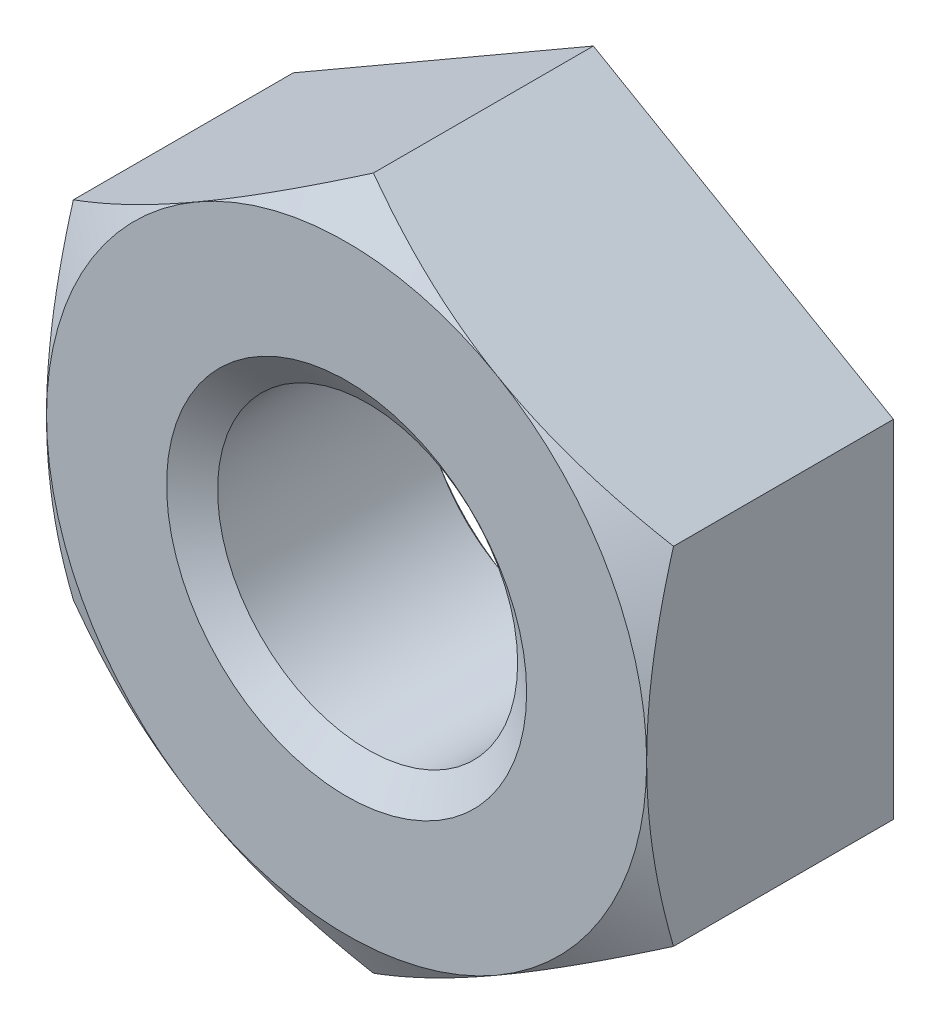
ISO-10303-21;
HEADER;
FILE_DESCRIPTION(('STEP AP214'),'2;1');
FILE_NAME('part.step','',(''),(''),'','','');
FILE_SCHEMA(('AUTOMOTIVE_DESIGN { 1 0 10303 214 1 1 1 1 }'));
ENDSEC;
DATA;
#1=APPLICATION_CONTEXT('core data for automotive mechanical design processes');
#2=APPLICATION_PROTOCOL_DEFINITION('international standard','automotive_design',2000,#1);
#3=PRODUCT_CONTEXT('',#1,'mechanical');
#4=PRODUCT('Part','Part','',(#3));
#5=PRODUCT_RELATED_PRODUCT_CATEGORY('part','',(#4));
#6=PRODUCT_DEFINITION_FORMATION('','',#4);
#7=PRODUCT_DEFINITION_CONTEXT('part definition',#1,'design');
#8=PRODUCT_DEFINITION('design','',#6,#7);
#9=PRODUCT_DEFINITION_SHAPE('','',#8);
#10=(LENGTH_UNIT() NAMED_UNIT(*) SI_UNIT(.MILLI.,.METRE.));
#11=(NAMED_UNIT(*) PLANE_ANGLE_UNIT() SI_UNIT($,.RADIAN.));
#12=(NAMED_UNIT(*) SI_UNIT($,.STERADIAN.) SOLID_ANGLE_UNIT());
#13=UNCERTAINTY_MEASURE_WITH_UNIT(LENGTH_MEASURE(1.E-05),#10,'distance_accuracy_value','');
#14=(GEOMETRIC_REPRESENTATION_CONTEXT(3) GLOBAL_UNCERTAINTY_ASSIGNED_CONTEXT((#13)) GLOBAL_UNIT_ASSIGNED_CONTEXT((#10,
#11,#12)) REPRESENTATION_CONTEXT('',''));
#15=CARTESIAN_POINT('',(0.,0.,0.));
#16=DIRECTION('',(0.,0.,1.));
#17=DIRECTION('',(1.,0.,0.));
#18=AXIS2_PLACEMENT_3D('',#15,#16,#17);
#19=CARTESIAN_POINT('',(0.,0.,-6.5278));
#20=DIRECTION('',(0.,0.,1.));
#21=DIRECTION('',(1.,0.,0.));
#22=AXIS2_PLACEMENT_3D('',#19,#20,#21);
#23=CYLINDRICAL_SURFACE('',#22,3.96875);
#24=CARTESIAN_POINT('',(0.,0.,-0.555789733453956));
#25=DIRECTION('',(0.,0.,1.));
#26=DIRECTION('',(1.,0.,0.));
#27=AXIS2_PLACEMENT_3D('',#24,#25,#26);
#28=CIRCLE('',#27,3.96875);
#29=CARTESIAN_POINT('',(3.96875,0.,-0.555789733453956));
#30=VERTEX_POINT('',#29);
#31=EDGE_CURVE('E131',#30,#30,#28,.F.);
#32=ORIENTED_EDGE('',*,*,#31,.F.);
#33=EDGE_LOOP('',(#32));
#34=FACE_BOUND('',#33,.T.);
#35=CARTESIAN_POINT('',(0.,0.,-5.94661026654604));
#36=DIRECTION('',(0.,0.,-1.));
#37=DIRECTION('',(-1.,0.,0.));
#38=AXIS2_PLACEMENT_3D('',#35,#36,#37);
#39=CIRCLE('',#38,3.96875);
#40=CARTESIAN_POINT('',(-3.96875,0.,-5.94661026654604));
#41=VERTEX_POINT('',#40);
#42=EDGE_CURVE('E37',#41,#41,#39,.F.);
#43=ORIENTED_EDGE('',*,*,#42,.F.);
#44=EDGE_LOOP('',(#43));
#45=FACE_BOUND('',#44,.T.);
#46=ADVANCED_FACE('F32',(#34,#45),#23,.F.);
#47=CARTESIAN_POINT('',(7.9375,13.7481532850777,-6.5278));
#48=DIRECTION('',(0.,0.,1.));
#49=DIRECTION('',(1.,0.,0.));
#50=AXIS2_PLACEMENT_3D('',#47,#48,#49);
#51=PLANE('',#50);
#52=DIRECTION('',(-0.866025403784448,-0.499999999999983,0.));
#53=VECTOR('',#52,1.);
#54=CARTESIAN_POINT('',(0.,9.16543552338532,-6.5278));
#55=LINE('',#54,#53);
#56=CARTESIAN_POINT('',(0.,9.16543552338532,-6.5278));
#57=VERTEX_POINT('',#56);
#58=CARTESIAN_POINT('',(-7.9375,4.58271776169282,-6.5278));
#59=VERTEX_POINT('',#58);
#60=EDGE_CURVE('E254',#57,#59,#55,.T.);
#61=ORIENTED_EDGE('',*,*,#60,.F.);
#62=DIRECTION('',(-0.866025403784428,0.500000000000019,0.));
#63=VECTOR('',#62,1.);
#64=CARTESIAN_POINT('',(7.9375,4.58271776169249,-6.5278));
#65=LINE('',#64,#63);
#66=CARTESIAN_POINT('',(7.9375,4.58271776169249,-6.5278));
#67=VERTEX_POINT('',#66);
#68=EDGE_CURVE('E230',#67,#57,#65,.T.);
#69=ORIENTED_EDGE('',*,*,#68,.F.);
#70=DIRECTION('',(0.,-1.,0.));
#71=VECTOR('',#70,1.);
#72=CARTESIAN_POINT('',(7.9375,4.58271776169249,-6.5278));
#73=LINE('',#72,#71);
#74=CARTESIAN_POINT('',(7.9375,-4.58271776169282,-6.5278));
#75=VERTEX_POINT('',#74);
#76=EDGE_CURVE('E243',#67,#75,#73,.T.);
#77=ORIENTED_EDGE('',*,*,#76,.T.);
#78=DIRECTION('',(0.866025403784449,0.499999999999982,0.));
#79=VECTOR('',#78,1.);
#80=CARTESIAN_POINT('',(0.,-9.1654355233853,-6.5278));
#81=LINE('',#80,#79);
#82=CARTESIAN_POINT('',(0.,-9.1654355233853,-6.5278));
#83=VERTEX_POINT('',#82);
#84=EDGE_CURVE('E245',#83,#75,#81,.T.);
#85=ORIENTED_EDGE('',*,*,#84,.F.);
#86=DIRECTION('',(0.866025403784429,-0.500000000000017,0.));
#87=VECTOR('',#86,1.);
#88=CARTESIAN_POINT('',(-7.9375,-4.58271776169249,-6.5278));
#89=LINE('',#88,#87);
#90=CARTESIAN_POINT('',(-7.9375,-4.58271776169249,-6.5278));
#91=VERTEX_POINT('',#90);
#92=EDGE_CURVE('E248',#91,#83,#89,.T.);
#93=ORIENTED_EDGE('',*,*,#92,.F.);
#94=DIRECTION('',(0.,-1.,0.));
#95=VECTOR('',#94,1.);
#96=CARTESIAN_POINT('',(-7.9375,4.58271776169282,-6.5278));
#97=LINE('',#96,#95);
#98=EDGE_CURVE('E251',#59,#91,#97,.T.);
#99=ORIENTED_EDGE('',*,*,#98,.F.);
#100=EDGE_LOOP('',(#61,#69,#77,#85,#93,#99));
#101=FACE_BOUND('',#100,.T.);
#102=CARTESIAN_POINT('',(0.,0.,-6.5278));
#103=DIRECTION('',(0.,0.,1.));
#104=DIRECTION('',(1.,0.,0.));
#105=AXIS2_PLACEMENT_3D('',#102,#103,#104);
#106=CIRCLE('',#105,4.7625);
#107=CARTESIAN_POINT('',(4.7625,0.,-6.5278));
#108=VERTEX_POINT('',#107);
#109=EDGE_CURVE('E215',#108,#108,#106,.F.);
#110=ORIENTED_EDGE('',*,*,#109,.F.);
#111=EDGE_LOOP('',(#110));
#112=FACE_BOUND('',#111,.T.);
#113=ADVANCED_FACE('F202',(#101,#112),#51,.F.);
#114=CARTESIAN_POINT('',(7.9375,13.7481532850777,0.));
#115=DIRECTION('',(0.,0.,1.));
#116=DIRECTION('',(1.,0.,0.));
#117=AXIS2_PLACEMENT_3D('',#114,#115,#116);
#118=PLANE('',#117);
#119=CARTESIAN_POINT('',(0.,0.,0.));
#120=DIRECTION('',(0.,0.,1.));
#121=DIRECTION('',(1.,0.,0.));
#122=AXIS2_PLACEMENT_3D('',#119,#120,#121);
#123=CIRCLE('',#122,7.9375);
#124=CARTESIAN_POINT('',(7.9375,0.,0.));
#125=VERTEX_POINT('',#124);
#126=CARTESIAN_POINT('',(3.96874999999985,-6.87407664253907,0.));
#127=VERTEX_POINT('',#126);
#128=EDGE_CURVE('E11',#125,#127,#123,.F.);
#129=ORIENTED_EDGE('',*,*,#128,.F.);
#130=CARTESIAN_POINT('',(0.,0.,0.));
#131=DIRECTION('',(0.,0.,1.));
#132=DIRECTION('',(1.,0.,0.));
#133=AXIS2_PLACEMENT_3D('',#130,#131,#132);
#134=CIRCLE('',#133,7.9375);
#135=CARTESIAN_POINT('',(3.96875000000015,6.8740766425389,0.));
#136=VERTEX_POINT('',#135);
#137=EDGE_CURVE('E123',#125,#136,#134,.T.);
#138=ORIENTED_EDGE('',*,*,#137,.T.);
#139=CARTESIAN_POINT('',(-3.96874999999987,6.87407664253906,0.));
#140=VERTEX_POINT('',#139);
#141=EDGE_CURVE('E44',#140,#136,#123,.F.);
#142=ORIENTED_EDGE('',*,*,#141,.F.);
#143=CARTESIAN_POINT('',(-7.9375,0.,0.));
#144=VERTEX_POINT('',#143);
#145=EDGE_CURVE('E283',#144,#140,#123,.F.);
#146=ORIENTED_EDGE('',*,*,#145,.F.);
#147=CARTESIAN_POINT('',(-3.96875000000013,-6.8740766425389,0.));
#148=VERTEX_POINT('',#147);
#149=EDGE_CURVE('E281',#148,#144,#123,.F.);
#150=ORIENTED_EDGE('',*,*,#149,.F.);
#151=EDGE_CURVE('E42',#127,#148,#123,.F.);
#152=ORIENTED_EDGE('',*,*,#151,.F.);
#153=EDGE_LOOP('',(#129,#138,#142,#146,#150,#152));
#154=FACE_BOUND('',#153,.T.);
#155=CARTESIAN_POINT('',(0.,0.,0.));
#156=DIRECTION('',(0.,0.,1.));
#157=DIRECTION('',(1.,0.,0.));
#158=AXIS2_PLACEMENT_3D('',#155,#156,#157);
#159=CIRCLE('',#158,4.7625);
#160=CARTESIAN_POINT('',(4.7625,0.,0.));
#161=VERTEX_POINT('',#160);
#162=EDGE_CURVE('E214',#161,#161,#159,.T.);
#163=ORIENTED_EDGE('',*,*,#162,.F.);
#164=EDGE_LOOP('',(#163));
#165=FACE_BOUND('',#164,.T.);
#166=ADVANCED_FACE('F133',(#154,#165),#118,.T.);
#167=CARTESIAN_POINT('',(0.,9.16543552338532,-6.5278));
#168=DIRECTION('',(-0.499999999999983,0.866025403784448,0.));
#169=DIRECTION('',(-0.866025403784448,-0.499999999999983,0.));
#170=AXIS2_PLACEMENT_3D('',#167,#168,#169);
#171=PLANE('',#170);
#172=DIRECTION('',(0.,0.,1.));
#173=VECTOR('',#172,1.);
#174=CARTESIAN_POINT('',(-7.9375,4.58271776169282,-6.5278));
#175=LINE('',#174,#173);
#176=CARTESIAN_POINT('',(-7.9375,4.58271776169282,-0.708948904974025));
#177=VERTEX_POINT('',#176);
#178=EDGE_CURVE('E226',#59,#177,#175,.T.);
#179=ORIENTED_EDGE('',*,*,#178,.T.);
#180=CARTESIAN_POINT('',(-7.9377,4.58260229163898,-0.709015572900557));
#181=CARTESIAN_POINT('',(-7.76322502158793,4.68333546739203,-0.650866285897806));
#182=CARTESIAN_POINT('',(-7.58809953864738,4.78444421210972,-0.595356039210498));
#183=CARTESIAN_POINT('',(-7.23642632358312,4.98748283749384,-0.490340491808437));
#184=CARTESIAN_POINT('',(-7.05987801235101,5.08941305250867,-0.440837783112786));
#185=CARTESIAN_POINT('',(-6.52740632749454,5.39683572309639,-0.302312723142144));
#186=CARTESIAN_POINT('',(-6.16938105017105,5.60354171333579,-0.22352145135917));
#187=CARTESIAN_POINT('',(-5.63360314162946,5.91287323305812,-0.131129350120179));
#188=CARTESIAN_POINT('',(-5.45745113218669,6.01457464312819,-0.104809503727462));
#189=CARTESIAN_POINT('',(-5.10435050058562,6.21843738783409,-0.0606755611211759));
#190=CARTESIAN_POINT('',(-4.92740195020686,6.32059868102797,-0.0428607133854932));
#191=CARTESIAN_POINT('',(-4.57320017052289,6.52509717387595,-0.0161882579708196));
#192=CARTESIAN_POINT('',(-4.39594751669924,6.6274340412756,-0.00732048505628382));
#193=CARTESIAN_POINT('',(-4.04127846358514,6.83220231456425,0.00126770549344349));
#194=CARTESIAN_POINT('',(-3.86386206952283,6.93463371743477,0.000988405729546576));
#195=CARTESIAN_POINT('',(-3.53217533850321,7.12613314087557,-0.00808134398121452));
#196=CARTESIAN_POINT('',(-3.37788159577035,7.21521467477666,-0.0157654088390289));
#197=CARTESIAN_POINT('',(-3.06965548223459,7.39316910439779,-0.0379026215782631));
#198=CARTESIAN_POINT('',(-2.91572313649499,7.48204198564753,-0.0523562257657692));
#199=CARTESIAN_POINT('',(-2.45452203220573,7.74831656735948,-0.105529699236206));
#200=CARTESIAN_POINT('',(-2.14806963971136,7.92524693865991,-0.154055589218117));
#201=CARTESIAN_POINT('',(-1.5319140460875,8.28098453650132,-0.275371211073317));
#202=CARTESIAN_POINT('',(-1.22228948290784,8.4597463614008,-0.348675201689165));
#203=CARTESIAN_POINT('',(-0.607657694775784,8.81460418973133,-0.51504499141566));
#204=CARTESIAN_POINT('',(-0.302642598800529,8.99070473749954,-0.608071713945547));
#205=CARTESIAN_POINT('',(0.000200000000093219,9.16555099343916,-0.709015572900516));
#206=B_SPLINE_CURVE_WITH_KNOTS('',3,(#180,#181,#182,#183,#184,#185,#186,#187,#188,#189,#190,
#191,#192,#193,#194,#195,#196,#197,#198,#199,#200,#201,#202,#203,#204,#205),.UNSPECIFIED.,.F.,
.F.,(4,2,2,2,2,2,2,2,2,2,2,2,4),(0.,0.629020687135161,1.25831181455686,2.51950872534228,
3.13466137542382,3.74975965907415,4.36415830804195,4.97853797504025,5.51339074736729,
6.04827957705292,7.11881916910901,8.21310135188793,9.30523536686631),.UNSPECIFIED.);
#207=EDGE_CURVE('E117',#177,#140,#206,.T.);
#208=ORIENTED_EDGE('',*,*,#207,.T.);
#209=CARTESIAN_POINT('',(0.,9.16543552338532,-0.708948904974024));
#210=VERTEX_POINT('',#209);
#211=EDGE_CURVE('E144',#140,#210,#206,.T.);
#212=ORIENTED_EDGE('',*,*,#211,.T.);
#213=DIRECTION('',(0.,0.,1.));
#214=VECTOR('',#213,1.);
#215=CARTESIAN_POINT('',(0.,9.16543552338532,-6.5278));
#216=LINE('',#215,#214);
#217=EDGE_CURVE('E238',#57,#210,#216,.T.);
#218=ORIENTED_EDGE('',*,*,#217,.F.);
#219=ORIENTED_EDGE('',*,*,#60,.T.);
#220=EDGE_LOOP('',(#179,#208,#212,#218,#219));
#221=FACE_BOUND('',#220,.T.);
#222=ADVANCED_FACE('F34',(#221),#171,.T.);
#223=CARTESIAN_POINT('',(7.9375,4.58271776169249,-6.5278));
#224=DIRECTION('',(0.500000000000019,0.866025403784428,0.));
#225=DIRECTION('',(-0.866025403784428,0.500000000000019,0.));
#226=AXIS2_PLACEMENT_3D('',#223,#224,#225);
#227=PLANE('',#226);
#228=ORIENTED_EDGE('',*,*,#217,.T.);
#229=CARTESIAN_POINT('',(-0.000199999999906354,9.16555099343916,-0.709015572900516));
#230=CARTESIAN_POINT('',(0.174274978412156,9.06481781768609,-0.650866285897766));
#231=CARTESIAN_POINT('',(0.349400461352702,8.9637090729684,-0.595356039210459));
#232=CARTESIAN_POINT('',(0.701073676416952,8.76067044758427,-0.490340491808398));
#233=CARTESIAN_POINT('',(0.877621987649049,8.65874023256944,-0.440837783112746));
#234=CARTESIAN_POINT('',(1.41009367250551,8.35131756198169,-0.302312723142103));
#235=CARTESIAN_POINT('',(1.76811894982899,8.14461157174228,-0.223521451359126));
#236=CARTESIAN_POINT('',(2.30389685837056,7.83528005201993,-0.131129350120134));
#237=CARTESIAN_POINT('',(2.48004886781333,7.73357864194985,-0.104809503727416));
#238=CARTESIAN_POINT('',(2.83314949941439,7.52971589724395,-0.0606755611211281));
#239=CARTESIAN_POINT('',(3.01009804979314,7.42755460405005,-0.0428607133854447));
#240=CARTESIAN_POINT('',(3.3642998294771,7.22305611120206,-0.0161882579707695));
#241=CARTESIAN_POINT('',(3.54155248330074,7.1207192438024,-0.00732048505623273));
#242=CARTESIAN_POINT('',(3.89622153641483,6.91595097051374,0.00126770549349606));
#243=CARTESIAN_POINT('',(4.07363793047713,6.81351956764322,0.000988405729599736));
#244=CARTESIAN_POINT('',(4.40532466149675,6.6220201442024,-0.00808134398115901));
#245=CARTESIAN_POINT('',(4.55961840422961,6.53293861030131,-0.0157654088389719));
#246=CARTESIAN_POINT('',(4.86784451776536,6.35498418068016,-0.037902621578205));
#247=CARTESIAN_POINT('',(5.02177686350495,6.26611129943041,-0.0523562257657114));
#248=CARTESIAN_POINT('',(5.48297796779421,5.99983671771844,-0.105529699236148));
#249=CARTESIAN_POINT('',(5.78943036028858,5.822906346418,-0.154055589218059));
#250=CARTESIAN_POINT('',(6.40558595391243,5.46716874857657,-0.275371211073259));
#251=CARTESIAN_POINT('',(6.71521051709208,5.28840692367706,-0.348675201689107));
#252=CARTESIAN_POINT('',(7.32984230522413,4.9335490953465,-0.515044991415605));
#253=CARTESIAN_POINT('',(7.63485740119938,4.75744854757828,-0.608071713945493));
#254=CARTESIAN_POINT('',(7.9377,4.58260229163865,-0.709015572900463));
#255=B_SPLINE_CURVE_WITH_KNOTS('',3,(#229,#230,#231,#232,#233,#234,#235,#236,#237,#238,#239,
#240,#241,#242,#243,#244,#245,#246,#247,#248,#249,#250,#251,#252,#253,#254),.UNSPECIFIED.,.F.,
.F.,(4,2,2,2,2,2,2,2,2,2,2,2,4),(0.,0.629020687135155,1.25831181455685,2.51950872534226,
3.1346613754238,3.74975965907412,4.36415830804191,4.97853797504022,5.51339074736726,
6.0482795770529,7.118819169109,8.21310135188792,9.30523536686632),.UNSPECIFIED.);
#256=EDGE_CURVE('E140',#210,#136,#255,.T.);
#257=ORIENTED_EDGE('',*,*,#256,.T.);
#258=CARTESIAN_POINT('',(7.9375,4.58271776169268,-0.708948904974024));
#259=VERTEX_POINT('',#258);
#260=EDGE_CURVE('E126',#136,#259,#255,.T.);
#261=ORIENTED_EDGE('',*,*,#260,.T.);
#262=DIRECTION('',(0.,0.,1.));
#263=VECTOR('',#262,1.);
#264=CARTESIAN_POINT('',(7.9375,4.58271776169249,-6.5278));
#265=LINE('',#264,#263);
#266=EDGE_CURVE('E139',#67,#259,#265,.T.);
#267=ORIENTED_EDGE('',*,*,#266,.F.);
#268=ORIENTED_EDGE('',*,*,#68,.T.);
#269=EDGE_LOOP('',(#228,#257,#261,#267,#268));
#270=FACE_BOUND('',#269,.T.);
#271=ADVANCED_FACE('F259',(#270),#227,.T.);
#272=CARTESIAN_POINT('',(7.9375,4.58271776169249,-6.5278));
#273=DIRECTION('',(-1.,0.,0.));
#274=DIRECTION('',(0.,0.,1.));
#275=AXIS2_PLACEMENT_3D('',#272,#273,#274);
#276=PLANE('',#275);
#277=CARTESIAN_POINT('',(7.9375,-12.1540428550748,-3.79830572339944));
#278=CARTESIAN_POINT('',(7.9375,-11.8055417137513,-3.62989072544695));
#279=CARTESIAN_POINT('',(7.9375,-11.4562166090856,-3.46314991100229));
#280=CARTESIAN_POINT('',(7.9375,-10.7554729351183,-3.13397333785365));
#281=CARTESIAN_POINT('',(7.9375,-10.4040540160887,-2.97153832452219));
#282=CARTESIAN_POINT('',(7.9375,-9.69677883875674,-2.65107432577963));
#283=CARTESIAN_POINT('',(7.9375,-9.34090869565808,-2.493075873726));
#284=CARTESIAN_POINT('',(7.9375,-8.62624353744283,-2.18386537817083));
#285=CARTESIAN_POINT('',(7.9375,-8.26744867594113,-2.03265298092497));
#286=CARTESIAN_POINT('',(7.9375,-7.54190895000615,-1.73702395542255));
#287=CARTESIAN_POINT('',(7.9375,-7.17512056255615,-1.59271354918174));
#288=CARTESIAN_POINT('',(7.9375,-6.4372184580145,-1.31539498874067));
#289=CARTESIAN_POINT('',(7.9375,-6.066104264908,-1.18238809199672));
#290=CARTESIAN_POINT('',(7.9375,-5.31971777432218,-0.931250932769843));
#291=CARTESIAN_POINT('',(7.9375,-4.94445623605253,-0.813089042609656));
#292=CARTESIAN_POINT('',(7.9375,-4.18861180807505,-0.595477465323819));
#293=CARTESIAN_POINT('',(7.9375,-3.80803064222036,-0.496021860734109));
#294=CARTESIAN_POINT('',(7.9375,-3.04122341725149,-0.320658395772122));
#295=CARTESIAN_POINT('',(7.9375,-2.65499588371972,-0.244756805288624));
#296=CARTESIAN_POINT('',(7.9375,-2.07225592781309,-0.152370391651535));
#297=CARTESIAN_POINT('',(7.9375,-1.87741892555741,-0.125150577555811));
#298=CARTESIAN_POINT('',(7.9375,-1.48683143967858,-0.0784018471326011));
#299=CARTESIAN_POINT('',(7.9375,-1.29108104843307,-0.0588721694033841));
#300=CARTESIAN_POINT('',(7.9375,-0.900173147631191,-0.0280292816344309));
#301=CARTESIAN_POINT('',(7.9375,-0.705019680022335,-0.0166650499450556));
#302=CARTESIAN_POINT('',(7.9375,-0.314406625859884,-0.00221313706756384));
#303=CARTESIAN_POINT('',(7.9375,-0.118947043314611,0.000874651601976459));
#304=CARTESIAN_POINT('',(7.9375,0.271871450970486,-0.00129989647433458));
#305=CARTESIAN_POINT('',(7.9375,0.467230375568073,-0.00655988978079132));
#306=CARTESIAN_POINT('',(7.9375,0.857556246985908,-0.0252991998003059));
#307=CARTESIAN_POINT('',(7.9375,1.05252317374343,-0.0387789269758079));
#308=CARTESIAN_POINT('',(7.9375,1.52506297457954,-0.0811297065316129));
#309=CARTESIAN_POINT('',(7.9375,1.80227278881696,-0.114119139529962));
#310=CARTESIAN_POINT('',(7.9375,2.35456818411291,-0.194883786983908));
#311=CARTESIAN_POINT('',(7.9375,2.62965316433381,-0.242663037198066));
#312=CARTESIAN_POINT('',(7.9375,3.17747194953975,-0.351312741869484));
#313=CARTESIAN_POINT('',(7.9375,3.45020327611589,-0.412195574142739));
#314=CARTESIAN_POINT('',(7.9375,3.99285991142013,-0.545194835610296));
#315=CARTESIAN_POINT('',(7.9375,4.26278548193587,-0.617310206545772));
#316=CARTESIAN_POINT('',(7.9375,4.80647881225565,-0.772934354165223));
#317=CARTESIAN_POINT('',(7.9375,5.08017856871108,-0.856679077611889));
#318=CARTESIAN_POINT('',(7.9375,5.62468506827777,-1.03244298730137));
#319=CARTESIAN_POINT('',(7.9375,5.89549366465436,-1.12445646631555));
#320=CARTESIAN_POINT('',(7.9375,6.43313118794731,-1.31485725841808));
#321=CARTESIAN_POINT('',(7.9375,6.69997393537356,-1.4132057801201));
#322=CARTESIAN_POINT('',(7.9375,7.23158910056609,-1.61567532168825));
#323=CARTESIAN_POINT('',(7.9375,7.49636063153353,-1.71979867460119));
#324=CARTESIAN_POINT('',(7.9375,7.76017027676662,-1.82623818485622));
#325=B_SPLINE_CURVE_WITH_KNOTS('',3,(#277,#278,#279,#280,#281,#282,#283,#284,#285,#286,#287,
#288,#289,#290,#291,#292,#293,#294,#295,#296,#297,#298,#299,#300,#301,#302,#303,#304,#305,#306,
#307,#308,#309,#310,#311,#312,#313,#314,#315,#316,#317,#318,#319,#320,#321,#322,#323,#324),
.UNSPECIFIED.,.F.,.F.,(4,2,2,2,2,2,2,2,2,2,2,2,2,2,2,2,2,2,2,2,2,2,2,4),(0.,1.16120027580623,
2.3226002700954,3.49064648750631,4.65863174596449,5.84095623854381,7.02341208683705,
8.20330434634276,9.38282273386193,10.5626548308775,11.1527144520002,11.7427156365191,
12.3289973680831,12.9152714859051,13.501381050453,14.0875198854945,14.9245510617841,
15.7618108438773,16.5998650111811,17.4378402700213,18.2963561134772,19.1542838811018,
20.007382654881,20.8608286295793),.UNSPECIFIED.);
#326=CARTESIAN_POINT('',(7.93749999999988,-4.58271776169289,-0.708948904974024));
#327=VERTEX_POINT('',#326);
#328=EDGE_CURVE('E106',#327,#125,#325,.T.);
#329=ORIENTED_EDGE('',*,*,#328,.F.);
#330=DIRECTION('',(0.,0.,1.));
#331=VECTOR('',#330,1.);
#332=CARTESIAN_POINT('',(7.9375,-4.58271776169282,-6.5278));
#333=LINE('',#332,#331);
#334=EDGE_CURVE('E235',#75,#327,#333,.T.);
#335=ORIENTED_EDGE('',*,*,#334,.F.);
#336=ORIENTED_EDGE('',*,*,#76,.F.);
#337=ORIENTED_EDGE('',*,*,#266,.T.);
#338=EDGE_CURVE('E119',#125,#259,#325,.T.);
#339=ORIENTED_EDGE('',*,*,#338,.F.);
#340=EDGE_LOOP('',(#329,#335,#336,#337,#339));
#341=FACE_BOUND('',#340,.T.);
#342=ADVANCED_FACE('F137',(#341),#276,.F.);
#343=CARTESIAN_POINT('',(0.,-9.1654355233853,-6.5278));
#344=DIRECTION('',(0.499999999999982,-0.866025403784449,0.));
#345=DIRECTION('',(0.866025403784449,0.499999999999982,0.));
#346=AXIS2_PLACEMENT_3D('',#343,#344,#345);
#347=PLANE('',#346);
#348=ORIENTED_EDGE('',*,*,#334,.T.);
#349=CARTESIAN_POINT('',(7.9377,-4.58260229163898,-0.709015572900558));
#350=CARTESIAN_POINT('',(7.76322502158793,-4.68333546739203,-0.650866285897806));
#351=CARTESIAN_POINT('',(7.58809953864738,-4.78444421210972,-0.595356039210498));
#352=CARTESIAN_POINT('',(7.23642632358312,-4.98748283749384,-0.490340491808437));
#353=CARTESIAN_POINT('',(7.05987801235102,-5.08941305250867,-0.440837783112786));
#354=CARTESIAN_POINT('',(6.52740632749454,-5.39683572309639,-0.302312723142144));
#355=CARTESIAN_POINT('',(6.16938105017104,-5.60354171333579,-0.223521451359168));
#356=CARTESIAN_POINT('',(5.63360314162946,-5.91287323305811,-0.131129350120177));
#357=CARTESIAN_POINT('',(5.45745113218668,-6.01457464312819,-0.10480950372746));
#358=CARTESIAN_POINT('',(5.10435050058561,-6.21843738783408,-0.0606755611211729));
#359=CARTESIAN_POINT('',(4.92740195020686,-6.32059868102797,-0.0428607133854897));
#360=CARTESIAN_POINT('',(4.57320017052289,-6.52509717387594,-0.0161882579708161));
#361=CARTESIAN_POINT('',(4.39594751669924,-6.6274340412756,-0.00732048505628075));
#362=CARTESIAN_POINT('',(4.04127846358514,-6.83220231456424,0.00126770549344693));
#363=CARTESIAN_POINT('',(3.86386206952283,-6.93463371743477,0.000988405729550845));
#364=CARTESIAN_POINT('',(3.5321753385032,-7.12613314087556,-0.00808134398120885));
#365=CARTESIAN_POINT('',(3.37788159577034,-7.21521467477665,-0.0157654088390226));
#366=CARTESIAN_POINT('',(3.06965548223458,-7.39316910439778,-0.0379026215782569));
#367=CARTESIAN_POINT('',(2.91572313649499,-7.48204198564752,-0.0523562257657636));
#368=CARTESIAN_POINT('',(2.45452203220573,-7.74831656735947,-0.105529699236201));
#369=CARTESIAN_POINT('',(2.14806963971136,-7.92524693865989,-0.15405558921811));
#370=CARTESIAN_POINT('',(1.5319140460875,-8.2809845365013,-0.275371211073308));
#371=CARTESIAN_POINT('',(1.22228948290784,-8.45974636140079,-0.348675201689155));
#372=CARTESIAN_POINT('',(0.607657694775785,-8.81460418973132,-0.51504499141565));
#373=CARTESIAN_POINT('',(0.30264259880053,-8.99070473749952,-0.608071713945536));
#374=CARTESIAN_POINT('',(-0.000200000000092865,-9.16555099343914,-0.709015572900504));
#375=B_SPLINE_CURVE_WITH_KNOTS('',3,(#349,#350,#351,#352,#353,#354,#355,#356,#357,#358,#359,
#360,#361,#362,#363,#364,#365,#366,#367,#368,#369,#370,#371,#372,#373,#374),.UNSPECIFIED.,.F.,
.F.,(4,2,2,2,2,2,2,2,2,2,2,2,4),(0.,0.62902068713516,1.25831181455686,2.51950872534228,
3.13466137542383,3.74975965907415,4.36415830804195,4.97853797504025,5.5133907473673,
6.04827957705292,7.11881916910901,8.21310135188792,9.3052353668663),.UNSPECIFIED.);
#376=EDGE_CURVE('E112',#327,#127,#375,.T.);
#377=ORIENTED_EDGE('',*,*,#376,.T.);
#378=CARTESIAN_POINT('',(0.,-9.16543552338532,-0.708948904974024));
#379=VERTEX_POINT('',#378);
#380=EDGE_CURVE('E51',#127,#379,#375,.T.);
#381=ORIENTED_EDGE('',*,*,#380,.T.);
#382=DIRECTION('',(0.,0.,1.));
#383=VECTOR('',#382,1.);
#384=CARTESIAN_POINT('',(0.,-9.1654355233853,-6.5278));
#385=LINE('',#384,#383);
#386=EDGE_CURVE('E232',#83,#379,#385,.T.);
#387=ORIENTED_EDGE('',*,*,#386,.F.);
#388=ORIENTED_EDGE('',*,*,#84,.T.);
#389=EDGE_LOOP('',(#348,#377,#381,#387,#388));
#390=FACE_BOUND('',#389,.T.);
#391=ADVANCED_FACE('F191',(#390),#347,.T.);
#392=CARTESIAN_POINT('',(-7.9375,-4.58271776169249,-6.5278));
#393=DIRECTION('',(-0.500000000000017,-0.866025403784429,0.));
#394=DIRECTION('',(0.866025403784429,-0.500000000000017,0.));
#395=AXIS2_PLACEMENT_3D('',#392,#393,#394);
#396=PLANE('',#395);
#397=ORIENTED_EDGE('',*,*,#386,.T.);
#398=CARTESIAN_POINT('',(0.000199999999906325,-9.16555099343914,-0.709015572900505));
#399=CARTESIAN_POINT('',(-0.174274978412156,-9.06481781768607,-0.650866285897754));
#400=CARTESIAN_POINT('',(-0.349400461352702,-8.96370907296838,-0.595356039210447));
#401=CARTESIAN_POINT('',(-0.701073676416951,-8.76067044758425,-0.490340491808387));
#402=CARTESIAN_POINT('',(-0.877621987649049,-8.65874023256942,-0.440837783112736));
#403=CARTESIAN_POINT('',(-1.41009367250551,-8.35131756198168,-0.302312723142094));
#404=CARTESIAN_POINT('',(-1.76811894982899,-8.14461157174226,-0.223521451359119));
#405=CARTESIAN_POINT('',(-2.30389685837056,-7.83528005201992,-0.131129350120127));
#406=CARTESIAN_POINT('',(-2.48004886781333,-7.73357864194984,-0.10480950372741));
#407=CARTESIAN_POINT('',(-2.83314949941438,-7.52971589724393,-0.0606755611211221));
#408=CARTESIAN_POINT('',(-3.01009804979313,-7.42755460405004,-0.0428607133854382));
#409=CARTESIAN_POINT('',(-3.36429982947709,-7.22305611120205,-0.0161882579707635));
#410=CARTESIAN_POINT('',(-3.54155248330074,-7.12071924380239,-0.00732048505622771));
#411=CARTESIAN_POINT('',(-3.89622153641483,-6.91595097051374,0.00126770549350055));
#412=CARTESIAN_POINT('',(-4.07363793047713,-6.81351956764321,0.000988405729604666));
#413=CARTESIAN_POINT('',(-4.40532466149675,-6.6220201442024,-0.00808134398115464));
#414=CARTESIAN_POINT('',(-4.5596184042296,-6.5329386103013,-0.0157654088389684));
#415=CARTESIAN_POINT('',(-4.86784451776536,-6.35498418068015,-0.0379026215782024));
#416=CARTESIAN_POINT('',(-5.02177686350495,-6.2661112994304,-0.0523562257657089));
#417=CARTESIAN_POINT('',(-5.48297796779421,-5.99983671771844,-0.105529699236146));
#418=CARTESIAN_POINT('',(-5.78943036028858,-5.822906346418,-0.154055589218057));
#419=CARTESIAN_POINT('',(-6.40558595391242,-5.46716874857657,-0.275371211073257));
#420=CARTESIAN_POINT('',(-6.71521051709208,-5.28840692367706,-0.348675201689105));
#421=CARTESIAN_POINT('',(-7.32984230522413,-4.93354909534651,-0.515044991415604));
#422=CARTESIAN_POINT('',(-7.63485740119938,-4.75744854757829,-0.608071713945493));
#423=CARTESIAN_POINT('',(-7.9377,-4.58260229163866,-0.709015572900464));
#424=B_SPLINE_CURVE_WITH_KNOTS('',3,(#398,#399,#400,#401,#402,#403,#404,#405,#406,#407,#408,
#409,#410,#411,#412,#413,#414,#415,#416,#417,#418,#419,#420,#421,#422,#423),.UNSPECIFIED.,.F.,
.F.,(4,2,2,2,2,2,2,2,2,2,2,2,4),(0.,0.629020687135154,1.25831181455685,2.51950872534225,
3.13466137542379,3.74975965907412,4.36415830804191,4.97853797504021,5.51339074736725,
6.04827957705289,7.11881916910898,8.21310135188791,9.3052353668663),.UNSPECIFIED.);
#425=EDGE_CURVE('E185',#379,#148,#424,.T.);
#426=ORIENTED_EDGE('',*,*,#425,.T.);
#427=CARTESIAN_POINT('',(-7.9375,-4.58271776169268,-0.708948904974024));
#428=VERTEX_POINT('',#427);
#429=EDGE_CURVE('E58',#148,#428,#424,.T.);
#430=ORIENTED_EDGE('',*,*,#429,.T.);
#431=DIRECTION('',(0.,0.,1.));
#432=VECTOR('',#431,1.);
#433=CARTESIAN_POINT('',(-7.9375,-4.58271776169249,-6.5278));
#434=LINE('',#433,#432);
#435=EDGE_CURVE('E229',#91,#428,#434,.T.);
#436=ORIENTED_EDGE('',*,*,#435,.F.);
#437=ORIENTED_EDGE('',*,*,#92,.T.);
#438=EDGE_LOOP('',(#397,#426,#430,#436,#437));
#439=FACE_BOUND('',#438,.T.);
#440=ADVANCED_FACE('F187',(#439),#396,.T.);
#441=CARTESIAN_POINT('',(-7.9375,4.58271776169282,-6.5278));
#442=DIRECTION('',(-1.,0.,0.));
#443=DIRECTION('',(0.,-1.,0.));
#444=AXIS2_PLACEMENT_3D('',#441,#442,#443);
#445=PLANE('',#444);
#446=ORIENTED_EDGE('',*,*,#435,.T.);
#447=CARTESIAN_POINT('',(-7.93750000000001,-12.1540428550746,-3.79830572339936));
#448=CARTESIAN_POINT('',(-7.9375,-11.8055417137511,-3.62989072544688));
#449=CARTESIAN_POINT('',(-7.9375,-11.4562166090855,-3.46314991100222));
#450=CARTESIAN_POINT('',(-7.9375,-10.7554729351181,-3.13397333785358));
#451=CARTESIAN_POINT('',(-7.9375,-10.4040540160885,-2.97153832452213));
#452=CARTESIAN_POINT('',(-7.9375,-9.69677883875659,-2.65107432577957));
#453=CARTESIAN_POINT('',(-7.9375,-9.34090869565794,-2.49307587372594));
#454=CARTESIAN_POINT('',(-7.9375,-8.6262435374427,-2.18386537817077));
#455=CARTESIAN_POINT('',(-7.9375,-8.26744867594099,-2.03265298092491));
#456=CARTESIAN_POINT('',(-7.9375,-7.54190895000601,-1.7370239554225));
#457=CARTESIAN_POINT('',(-7.9375,-7.17512056255602,-1.59271354918169));
#458=CARTESIAN_POINT('',(-7.9375,-6.43721845801438,-1.31539498874063));
#459=CARTESIAN_POINT('',(-7.9375,-6.06610426490787,-1.18238809199668));
#460=CARTESIAN_POINT('',(-7.9375,-5.31971777432206,-0.931250932769806));
#461=CARTESIAN_POINT('',(-7.9375,-4.94445623605241,-0.813089042609621));
#462=CARTESIAN_POINT('',(-7.9375,-4.18861180807494,-0.595477465323789));
#463=CARTESIAN_POINT('',(-7.9375,-3.80803064222025,-0.496021860734083));
#464=CARTESIAN_POINT('',(-7.9375,-3.04122341725139,-0.320658395772102));
#465=CARTESIAN_POINT('',(-7.9375,-2.65499588371962,-0.244756805288607));
#466=CARTESIAN_POINT('',(-7.9375,-2.072255927813,-0.152370391651522));
#467=CARTESIAN_POINT('',(-7.9375,-1.87741892555732,-0.1251505775558));
#468=CARTESIAN_POINT('',(-7.9375,-1.48683143967849,-0.0784018471325929));
#469=CARTESIAN_POINT('',(-7.9375,-1.29108104843298,-0.0588721694033772));
#470=CARTESIAN_POINT('',(-7.9375,-0.900173147631109,-0.0280292816344263));
#471=CARTESIAN_POINT('',(-7.9375,-0.705019680022254,-0.0166650499450518));
#472=CARTESIAN_POINT('',(-7.9375,-0.314406625859806,-0.00221313706756185));
#473=CARTESIAN_POINT('',(-7.9375,-0.118947043314535,0.000874651601977485));
#474=CARTESIAN_POINT('',(-7.9375,0.271871450970559,-0.00129989647433558));
#475=CARTESIAN_POINT('',(-7.9375,0.467230375568144,-0.00655988978079341));
#476=CARTESIAN_POINT('',(-7.9375,0.857556246985976,-0.0252991998003095));
#477=CARTESIAN_POINT('',(-7.9375,1.0525231737435,-0.0387789269758119));
#478=CARTESIAN_POINT('',(-7.9375,1.5250629745796,-0.0811297065316192));
#479=CARTESIAN_POINT('',(-7.9375,1.80227278881703,-0.114119139529971));
#480=CARTESIAN_POINT('',(-7.9375,2.35456818411298,-0.194883786983921));
#481=CARTESIAN_POINT('',(-7.9375,2.62965316433389,-0.24266303719808));
#482=CARTESIAN_POINT('',(-7.9375,3.17747194953983,-0.3513127418695));
#483=CARTESIAN_POINT('',(-7.9375,3.45020327611598,-0.412195574142757));
#484=CARTESIAN_POINT('',(-7.9375,3.99285991142022,-0.545194835610317));
#485=CARTESIAN_POINT('',(-7.9375,4.26278548193595,-0.617310206545795));
#486=CARTESIAN_POINT('',(-7.9375,4.80647881225574,-0.772934354165248));
#487=CARTESIAN_POINT('',(-7.9375,5.08017856871117,-0.856679077611916));
#488=CARTESIAN_POINT('',(-7.9375,5.62468506827787,-1.0324429873014));
#489=CARTESIAN_POINT('',(-7.9375,5.89549366465446,-1.12445646631558));
#490=CARTESIAN_POINT('',(-7.9375,6.43313118794741,-1.31485725841811));
#491=CARTESIAN_POINT('',(-7.9375,6.69997393537366,-1.41320578012014));
#492=CARTESIAN_POINT('',(-7.9375,7.23158910056619,-1.61567532168829));
#493=CARTESIAN_POINT('',(-7.9375,7.49636063153364,-1.71979867460123));
#494=CARTESIAN_POINT('',(-7.9375,7.76017027676673,-1.82623818485627));
#495=B_SPLINE_CURVE_WITH_KNOTS('',3,(#447,#448,#449,#450,#451,#452,#453,#454,#455,#456,#457,
#458,#459,#460,#461,#462,#463,#464,#465,#466,#467,#468,#469,#470,#471,#472,#473,#474,#475,#476,
#477,#478,#479,#480,#481,#482,#483,#484,#485,#486,#487,#488,#489,#490,#491,#492,#493,#494),
.UNSPECIFIED.,.F.,.F.,(4,2,2,2,2,2,2,2,2,2,2,2,2,2,2,2,2,2,2,2,2,2,2,4),(0.,1.16120027580622,
2.32260027009538,3.49064648750628,4.65863174596446,5.84095623854378,7.023412086837,
8.2033043463427,9.38282273386186,10.5626548308774,11.1527144520001,11.742715636519,
12.328997368083,12.915271485905,13.5013810504529,14.0875198854944,14.924551061784,
15.7618108438772,16.599865011181,17.4378402700213,18.2963561134771,19.1542838811018,
20.0073826548809,20.8608286295792),.UNSPECIFIED.);
#496=EDGE_CURVE('E186',#428,#144,#495,.T.);
#497=ORIENTED_EDGE('',*,*,#496,.T.);
#498=EDGE_CURVE('E130',#144,#177,#495,.T.);
#499=ORIENTED_EDGE('',*,*,#498,.T.);
#500=ORIENTED_EDGE('',*,*,#178,.F.);
#501=ORIENTED_EDGE('',*,*,#98,.T.);
#502=EDGE_LOOP('',(#446,#497,#499,#500,#501));
#503=FACE_BOUND('',#502,.T.);
#504=ADVANCED_FACE('F190',(#503),#445,.T.);
#505=CARTESIAN_POINT('',(0.,0.,0.));
#506=DIRECTION('',(0.,0.,-1.));
#507=DIRECTION('',(-1.,0.,0.));
#508=AXIS2_PLACEMENT_3D('',#505,#506,#507);
#509=CONICAL_SURFACE('',#508,7.9375,1.04719755119659);
#510=ORIENTED_EDGE('',*,*,#137,.F.);
#511=ORIENTED_EDGE('',*,*,#338,.T.);
#512=ORIENTED_EDGE('',*,*,#260,.F.);
#513=EDGE_LOOP('',(#510,#511,#512));
#514=FACE_BOUND('',#513,.T.);
#515=ADVANCED_FACE('F124',(#514),#509,.T.);
#516=ORIENTED_EDGE('',*,*,#141,.T.);
#517=ORIENTED_EDGE('',*,*,#256,.F.);
#518=ORIENTED_EDGE('',*,*,#211,.F.);
#519=EDGE_LOOP('',(#516,#517,#518));
#520=FACE_BOUND('',#519,.T.);
#521=ADVANCED_FACE('F168',(#520),#509,.T.);
#522=ORIENTED_EDGE('',*,*,#498,.F.);
#523=ORIENTED_EDGE('',*,*,#145,.T.);
#524=ORIENTED_EDGE('',*,*,#207,.F.);
#525=EDGE_LOOP('',(#522,#523,#524));
#526=FACE_BOUND('',#525,.T.);
#527=ADVANCED_FACE('F167',(#526),#509,.T.);
#528=ORIENTED_EDGE('',*,*,#149,.T.);
#529=ORIENTED_EDGE('',*,*,#496,.F.);
#530=ORIENTED_EDGE('',*,*,#429,.F.);
#531=EDGE_LOOP('',(#528,#529,#530));
#532=FACE_BOUND('',#531,.T.);
#533=ADVANCED_FACE('F161',(#532),#509,.T.);
#534=ORIENTED_EDGE('',*,*,#151,.T.);
#535=ORIENTED_EDGE('',*,*,#425,.F.);
#536=ORIENTED_EDGE('',*,*,#380,.F.);
#537=EDGE_LOOP('',(#534,#535,#536));
#538=FACE_BOUND('',#537,.T.);
#539=ADVANCED_FACE('F166',(#538),#509,.T.);
#540=ORIENTED_EDGE('',*,*,#328,.T.);
#541=ORIENTED_EDGE('',*,*,#128,.T.);
#542=ORIENTED_EDGE('',*,*,#376,.F.);
#543=EDGE_LOOP('',(#540,#541,#542));
#544=FACE_BOUND('',#543,.T.);
#545=ADVANCED_FACE('F108',(#544),#509,.T.);
#546=CARTESIAN_POINT('',(0.,0.,-0.611368706799353));
#547=DIRECTION('',(0.,0.,1.));
#548=DIRECTION('',(1.,0.,0.));
#549=AXIS2_PLACEMENT_3D('',#546,#547,#548);
#550=CONICAL_SURFACE('',#549,3.889375,0.959931088596878);
#551=ORIENTED_EDGE('',*,*,#162,.T.);
#552=EDGE_LOOP('',(#551));
#553=FACE_BOUND('',#552,.T.);
#554=ORIENTED_EDGE('',*,*,#31,.T.);
#555=EDGE_LOOP('',(#554));
#556=FACE_BOUND('',#555,.T.);
#557=ADVANCED_FACE('F169',(#553,#556),#550,.F.);
#558=CARTESIAN_POINT('',(0.,0.,-6.5024));
#559=DIRECTION('',(0.,0.,-1.));
#560=DIRECTION('',(-1.,0.,0.));
#561=AXIS2_PLACEMENT_3D('',#558,#559,#560);
#562=CONICAL_SURFACE('',#561,4.7625,0.959931088596881);
#563=CARTESIAN_POINT('',(0.,0.,-6.5024));
#564=DIRECTION('',(0.,0.,1.));
#565=DIRECTION('',(1.,0.,0.));
#566=AXIS2_PLACEMENT_3D('',#563,#564,#565);
#567=CIRCLE('',#566,4.7625);
#568=CARTESIAN_POINT('',(4.7625,0.,-6.5024));
#569=VERTEX_POINT('',#568);
#570=EDGE_CURVE('E219',#569,#569,#567,.T.);
#571=ORIENTED_EDGE('',*,*,#570,.F.);
#572=EDGE_LOOP('',(#571));
#573=FACE_BOUND('',#572,.T.);
#574=ORIENTED_EDGE('',*,*,#42,.T.);
#575=EDGE_LOOP('',(#574));
#576=FACE_BOUND('',#575,.T.);
#577=ADVANCED_FACE('F379',(#573,#576),#562,.F.);
#578=CARTESIAN_POINT('',(0.,0.,-25.0375057290932));
#579=DIRECTION('',(0.,0.,1.));
#580=DIRECTION('',(1.,0.,0.));
#581=AXIS2_PLACEMENT_3D('',#578,#579,#580);
#582=CYLINDRICAL_SURFACE('',#581,4.7625);
#583=ORIENTED_EDGE('',*,*,#570,.T.);
#584=EDGE_LOOP('',(#583));
#585=FACE_BOUND('',#584,.T.);
#586=ORIENTED_EDGE('',*,*,#109,.T.);
#587=EDGE_LOOP('',(#586));
#588=FACE_BOUND('',#587,.T.);
#589=ADVANCED_FACE('F387',(#585,#588),#582,.F.);
#590=CLOSED_SHELL('',(#46,#113,#166,#222,#271,#342,#391,#440,#504,#515,#521,#527,#533,#539,#545,
#557,#577,#589));
#591=MANIFOLD_SOLID_BREP('B2',#590);
#592=ADVANCED_BREP_SHAPE_REPRESENTATION('',(#18,#591),#14);
#593=SHAPE_DEFINITION_REPRESENTATION(#9,#592);
ENDSEC;
END-ISO-10303-21;
